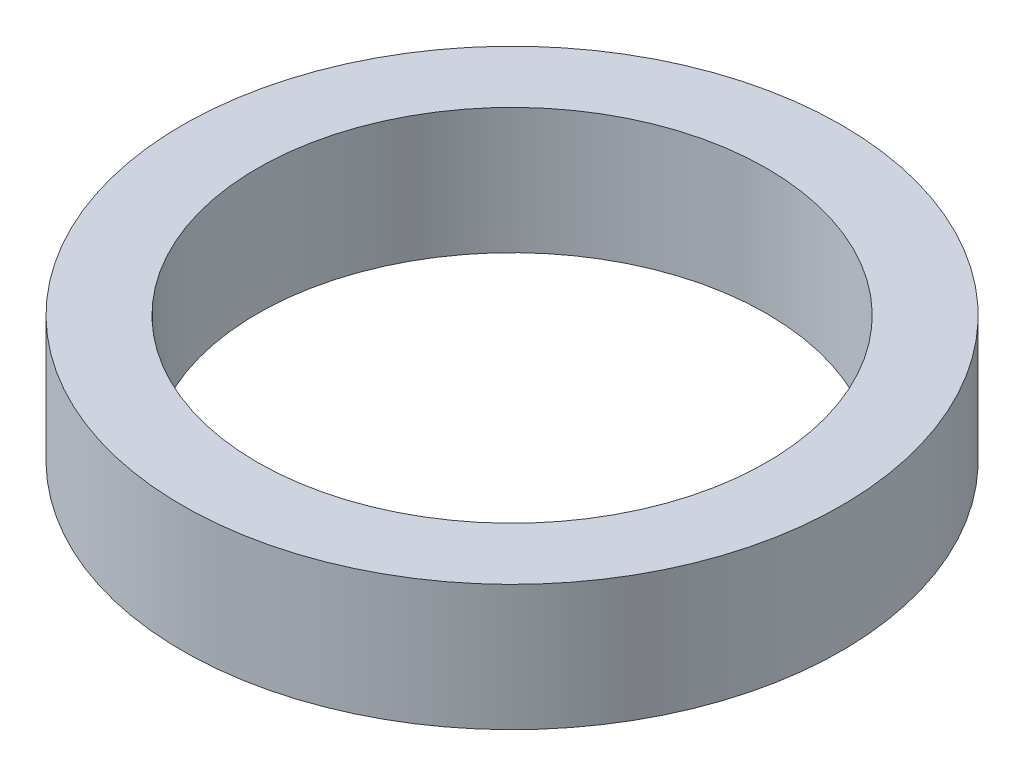
ISO-10303-21;
HEADER;
FILE_DESCRIPTION(('STEP AP214'),'2;1');
FILE_NAME('part.step','',(''),(''),'','','');
FILE_SCHEMA(('AUTOMOTIVE_DESIGN { 1 0 10303 214 1 1 1 1 }'));
ENDSEC;
DATA;
#1=APPLICATION_CONTEXT('core data for automotive mechanical design processes');
#2=APPLICATION_PROTOCOL_DEFINITION('international standard','automotive_design',2000,#1);
#3=PRODUCT_CONTEXT('',#1,'mechanical');
#4=PRODUCT('Part','Part','',(#3));
#5=PRODUCT_RELATED_PRODUCT_CATEGORY('part','',(#4));
#6=PRODUCT_DEFINITION_FORMATION('','',#4);
#7=PRODUCT_DEFINITION_CONTEXT('part definition',#1,'design');
#8=PRODUCT_DEFINITION('design','',#6,#7);
#9=PRODUCT_DEFINITION_SHAPE('','',#8);
#10=(LENGTH_UNIT() NAMED_UNIT(*) SI_UNIT(.MILLI.,.METRE.));
#11=(NAMED_UNIT(*) PLANE_ANGLE_UNIT() SI_UNIT($,.RADIAN.));
#12=(NAMED_UNIT(*) SI_UNIT($,.STERADIAN.) SOLID_ANGLE_UNIT());
#13=UNCERTAINTY_MEASURE_WITH_UNIT(LENGTH_MEASURE(1.E-05),#10,'distance_accuracy_value','');
#14=(GEOMETRIC_REPRESENTATION_CONTEXT(3) GLOBAL_UNCERTAINTY_ASSIGNED_CONTEXT((#13)) GLOBAL_UNIT_ASSIGNED_CONTEXT((#10,
#11,#12)) REPRESENTATION_CONTEXT('',''));
#15=CARTESIAN_POINT('',(0.,0.,0.));
#16=DIRECTION('',(0.,0.,1.));
#17=DIRECTION('',(1.,0.,0.));
#18=AXIS2_PLACEMENT_3D('',#15,#16,#17);
#19=CARTESIAN_POINT('',(0.,21.,0.));
#20=DIRECTION('',(0.,-1.,0.));
#21=DIRECTION('',(0.,0.,-1.));
#22=AXIS2_PLACEMENT_3D('',#19,#20,#21);
#23=CYLINDRICAL_SURFACE('',#22,55.);
#24=CARTESIAN_POINT('',(0.,21.,0.));
#25=DIRECTION('',(0.,1.,0.));
#26=DIRECTION('',(0.,0.,1.));
#27=AXIS2_PLACEMENT_3D('',#24,#25,#26);
#28=CIRCLE('',#27,55.);
#29=CARTESIAN_POINT('',(0.,21.,-55.));
#30=VERTEX_POINT('',#29);
#31=EDGE_CURVE('E10',#30,#30,#28,.T.);
#32=CARTESIAN_POINT('',(0.,0.,0.));
#33=DIRECTION('',(0.,1.,0.));
#34=DIRECTION('',(0.,0.,1.));
#35=AXIS2_PLACEMENT_3D('',#32,#33,#34);
#36=CIRCLE('',#35,55.);
#37=CARTESIAN_POINT('',(0.,0.,-55.));
#38=VERTEX_POINT('',#37);
#39=EDGE_CURVE('E37',#38,#38,#36,.T.);
#40=CARTESIAN_POINT('',(0.,21.,-55.));
#41=CARTESIAN_POINT('',(0.,20.78125,-55.));
#42=CARTESIAN_POINT('',(0.,20.5625,-55.));
#43=CARTESIAN_POINT('',(0.,20.125,-55.));
#44=CARTESIAN_POINT('',(0.,19.90625,-55.));
#45=CARTESIAN_POINT('',(0.,19.46875,-55.));
#46=CARTESIAN_POINT('',(0.,19.25,-55.));
#47=CARTESIAN_POINT('',(0.,18.8125,-55.));
#48=CARTESIAN_POINT('',(0.,18.59375,-55.));
#49=CARTESIAN_POINT('',(0.,18.15625,-55.));
#50=CARTESIAN_POINT('',(0.,17.9375,-55.));
#51=CARTESIAN_POINT('',(0.,17.5,-55.));
#52=CARTESIAN_POINT('',(0.,17.28125,-55.));
#53=CARTESIAN_POINT('',(0.,16.84375,-55.));
#54=CARTESIAN_POINT('',(0.,16.625,-55.));
#55=CARTESIAN_POINT('',(0.,16.1875,-55.));
#56=CARTESIAN_POINT('',(0.,15.96875,-55.));
#57=CARTESIAN_POINT('',(0.,15.53125,-55.));
#58=CARTESIAN_POINT('',(0.,15.3125,-55.));
#59=CARTESIAN_POINT('',(0.,14.875,-55.));
#60=CARTESIAN_POINT('',(0.,14.65625,-55.));
#61=CARTESIAN_POINT('',(0.,14.21875,-55.));
#62=CARTESIAN_POINT('',(0.,14.,-55.));
#63=CARTESIAN_POINT('',(0.,13.5625,-55.));
#64=CARTESIAN_POINT('',(0.,13.34375,-55.));
#65=CARTESIAN_POINT('',(0.,12.90625,-55.));
#66=CARTESIAN_POINT('',(0.,12.6875,-55.));
#67=CARTESIAN_POINT('',(0.,12.25,-55.));
#68=CARTESIAN_POINT('',(0.,12.03125,-55.));
#69=CARTESIAN_POINT('',(0.,11.59375,-55.));
#70=CARTESIAN_POINT('',(0.,11.375,-55.));
#71=CARTESIAN_POINT('',(0.,10.9375,-55.));
#72=CARTESIAN_POINT('',(0.,10.71875,-55.));
#73=CARTESIAN_POINT('',(0.,10.28125,-55.));
#74=CARTESIAN_POINT('',(0.,10.0625,-55.));
#75=CARTESIAN_POINT('',(0.,9.625,-55.));
#76=CARTESIAN_POINT('',(0.,9.40625,-55.));
#77=CARTESIAN_POINT('',(0.,8.96875,-55.));
#78=CARTESIAN_POINT('',(0.,8.75,-55.));
#79=CARTESIAN_POINT('',(0.,8.3125,-55.));
#80=CARTESIAN_POINT('',(0.,8.09375,-55.));
#81=CARTESIAN_POINT('',(0.,7.65625,-55.));
#82=CARTESIAN_POINT('',(0.,7.4375,-55.));
#83=CARTESIAN_POINT('',(0.,7.,-55.));
#84=CARTESIAN_POINT('',(0.,6.78125,-55.));
#85=CARTESIAN_POINT('',(0.,6.34375,-55.));
#86=CARTESIAN_POINT('',(0.,6.125,-55.));
#87=CARTESIAN_POINT('',(0.,5.6875,-55.));
#88=CARTESIAN_POINT('',(0.,5.46875,-55.));
#89=CARTESIAN_POINT('',(0.,5.03125,-55.));
#90=CARTESIAN_POINT('',(0.,4.8125,-55.));
#91=CARTESIAN_POINT('',(0.,4.375,-55.));
#92=CARTESIAN_POINT('',(0.,4.15625,-55.));
#93=CARTESIAN_POINT('',(0.,3.71875,-55.));
#94=CARTESIAN_POINT('',(0.,3.5,-55.));
#95=CARTESIAN_POINT('',(0.,3.0625,-55.));
#96=CARTESIAN_POINT('',(0.,2.84375,-55.));
#97=CARTESIAN_POINT('',(0.,2.40625,-55.));
#98=CARTESIAN_POINT('',(0.,2.1875,-55.));
#99=CARTESIAN_POINT('',(0.,1.75,-55.));
#100=CARTESIAN_POINT('',(0.,1.53125,-55.));
#101=CARTESIAN_POINT('',(0.,1.09375,-55.));
#102=CARTESIAN_POINT('',(0.,0.875000000000001,-55.));
#103=CARTESIAN_POINT('',(0.,0.4375,-55.));
#104=CARTESIAN_POINT('',(0.,0.21875,-55.));
#105=CARTESIAN_POINT('',(0.,0.,-55.));
#106=B_SPLINE_CURVE_WITH_KNOTS('',3,(#40,#41,#42,#43,#44,#45,#46,#47,#48,#49,#50,#51,#52,#53,
#54,#55,#56,#57,#58,#59,#60,#61,#62,#63,#64,#65,#66,#67,#68,#69,#70,#71,#72,#73,#74,#75,#76,#77,
#78,#79,#80,#81,#82,#83,#84,#85,#86,#87,#88,#89,#90,#91,#92,#93,#94,#95,#96,#97,#98,#99,#100,
#101,#102,#103,#104,#105),.UNSPECIFIED.,.F.,.F.,(4,2,2,2,2,2,2,2,2,2,2,2,2,2,2,2,2,2,2,2,2,2,2,
2,2,2,2,2,2,2,2,2,4),(0.,0.656250000000001,1.3125,1.96875,2.625,3.28125,3.9375,4.59375,5.25,
5.90625,6.5625,7.21875,7.875,8.53125,9.1875,9.84375,10.5,11.15625,11.8125,12.46875,13.125,
13.78125,14.4375,15.09375,15.75,16.40625,17.0625,17.71875,18.375,19.03125,19.6875,20.34375,21.),.UNSPECIFIED.);
#107=EDGE_CURVE('BSEAM40',#30,#38,#106,.T.);
#108=ORIENTED_EDGE('',*,*,#31,.F.);
#109=ORIENTED_EDGE('',*,*,#39,.T.);
#110=ORIENTED_EDGE('',*,*,#107,.T.);
#111=ORIENTED_EDGE('',*,*,#107,.F.);
#112=EDGE_LOOP('',(#108,#110,#109,#111));
#113=FACE_BOUND('',#112,.T.);
#114=ADVANCED_FACE('F40',(#113),#23,.T.);
#115=CARTESIAN_POINT('',(0.,21.,0.));
#116=DIRECTION('',(0.,1.,0.));
#117=DIRECTION('',(0.,0.,1.));
#118=AXIS2_PLACEMENT_3D('',#115,#116,#117);
#119=PLANE('',#118);
#120=CARTESIAN_POINT('',(0.,21.,0.));
#121=DIRECTION('',(0.,1.,0.));
#122=DIRECTION('',(0.,0.,1.));
#123=AXIS2_PLACEMENT_3D('',#120,#121,#122);
#124=CIRCLE('',#123,42.5);
#125=CARTESIAN_POINT('',(0.,21.,-42.5));
#126=VERTEX_POINT('',#125);
#127=EDGE_CURVE('E50',#126,#126,#124,.T.);
#128=ORIENTED_EDGE('',*,*,#127,.F.);
#129=EDGE_LOOP('',(#128));
#130=FACE_BOUND('',#129,.T.);
#131=ORIENTED_EDGE('',*,*,#31,.T.);
#132=EDGE_LOOP('',(#131));
#133=FACE_BOUND('',#132,.T.);
#134=ADVANCED_FACE('F59',(#130,#133),#119,.T.);
#135=CARTESIAN_POINT('',(0.,0.,0.));
#136=DIRECTION('',(0.,1.,0.));
#137=DIRECTION('',(0.,0.,1.));
#138=AXIS2_PLACEMENT_3D('',#135,#136,#137);
#139=PLANE('',#138);
#140=CARTESIAN_POINT('',(0.,0.,0.));
#141=DIRECTION('',(0.,1.,0.));
#142=DIRECTION('',(0.,0.,1.));
#143=AXIS2_PLACEMENT_3D('',#140,#141,#142);
#144=CIRCLE('',#143,42.5);
#145=CARTESIAN_POINT('',(0.,0.,-42.5));
#146=VERTEX_POINT('',#145);
#147=EDGE_CURVE('E47',#146,#146,#144,.T.);
#148=ORIENTED_EDGE('',*,*,#147,.T.);
#149=EDGE_LOOP('',(#148));
#150=FACE_BOUND('',#149,.T.);
#151=ORIENTED_EDGE('',*,*,#39,.F.);
#152=EDGE_LOOP('',(#151));
#153=FACE_BOUND('',#152,.T.);
#154=ADVANCED_FACE('F58',(#150,#153),#139,.F.);
#155=CARTESIAN_POINT('',(0.,21.,0.));
#156=DIRECTION('',(0.,-1.,0.));
#157=DIRECTION('',(0.,0.,-1.));
#158=AXIS2_PLACEMENT_3D('',#155,#156,#157);
#159=CYLINDRICAL_SURFACE('',#158,42.5);
#160=CARTESIAN_POINT('',(0.,21.,-42.5));
#161=CARTESIAN_POINT('',(0.,20.78125,-42.5));
#162=CARTESIAN_POINT('',(0.,20.5625,-42.5));
#163=CARTESIAN_POINT('',(0.,20.125,-42.5));
#164=CARTESIAN_POINT('',(0.,19.90625,-42.5));
#165=CARTESIAN_POINT('',(0.,19.46875,-42.5));
#166=CARTESIAN_POINT('',(0.,19.25,-42.5));
#167=CARTESIAN_POINT('',(0.,18.8125,-42.5));
#168=CARTESIAN_POINT('',(0.,18.59375,-42.5));
#169=CARTESIAN_POINT('',(0.,18.15625,-42.5));
#170=CARTESIAN_POINT('',(0.,17.9375,-42.5));
#171=CARTESIAN_POINT('',(0.,17.5,-42.5));
#172=CARTESIAN_POINT('',(0.,17.28125,-42.5));
#173=CARTESIAN_POINT('',(0.,16.84375,-42.5));
#174=CARTESIAN_POINT('',(0.,16.625,-42.5));
#175=CARTESIAN_POINT('',(0.,16.1875,-42.5));
#176=CARTESIAN_POINT('',(0.,15.96875,-42.5));
#177=CARTESIAN_POINT('',(0.,15.53125,-42.5));
#178=CARTESIAN_POINT('',(0.,15.3125,-42.5));
#179=CARTESIAN_POINT('',(0.,14.875,-42.5));
#180=CARTESIAN_POINT('',(0.,14.65625,-42.5));
#181=CARTESIAN_POINT('',(0.,14.21875,-42.5));
#182=CARTESIAN_POINT('',(0.,14.,-42.5));
#183=CARTESIAN_POINT('',(0.,13.5625,-42.5));
#184=CARTESIAN_POINT('',(0.,13.34375,-42.5));
#185=CARTESIAN_POINT('',(0.,12.90625,-42.5));
#186=CARTESIAN_POINT('',(0.,12.6875,-42.5));
#187=CARTESIAN_POINT('',(0.,12.25,-42.5));
#188=CARTESIAN_POINT('',(0.,12.03125,-42.5));
#189=CARTESIAN_POINT('',(0.,11.59375,-42.5));
#190=CARTESIAN_POINT('',(0.,11.375,-42.5));
#191=CARTESIAN_POINT('',(0.,10.9375,-42.5));
#192=CARTESIAN_POINT('',(0.,10.71875,-42.5));
#193=CARTESIAN_POINT('',(0.,10.28125,-42.5));
#194=CARTESIAN_POINT('',(0.,10.0625,-42.5));
#195=CARTESIAN_POINT('',(0.,9.625,-42.5));
#196=CARTESIAN_POINT('',(0.,9.40625,-42.5));
#197=CARTESIAN_POINT('',(0.,8.96875,-42.5));
#198=CARTESIAN_POINT('',(0.,8.75,-42.5));
#199=CARTESIAN_POINT('',(0.,8.3125,-42.5));
#200=CARTESIAN_POINT('',(0.,8.09375,-42.5));
#201=CARTESIAN_POINT('',(0.,7.65625,-42.5));
#202=CARTESIAN_POINT('',(0.,7.4375,-42.5));
#203=CARTESIAN_POINT('',(0.,7.,-42.5));
#204=CARTESIAN_POINT('',(0.,6.78125,-42.5));
#205=CARTESIAN_POINT('',(0.,6.34375,-42.5));
#206=CARTESIAN_POINT('',(0.,6.125,-42.5));
#207=CARTESIAN_POINT('',(0.,5.6875,-42.5));
#208=CARTESIAN_POINT('',(0.,5.46875,-42.5));
#209=CARTESIAN_POINT('',(0.,5.03125,-42.5));
#210=CARTESIAN_POINT('',(0.,4.8125,-42.5));
#211=CARTESIAN_POINT('',(0.,4.375,-42.5));
#212=CARTESIAN_POINT('',(0.,4.15625,-42.5));
#213=CARTESIAN_POINT('',(0.,3.71875,-42.5));
#214=CARTESIAN_POINT('',(0.,3.5,-42.5));
#215=CARTESIAN_POINT('',(0.,3.0625,-42.5));
#216=CARTESIAN_POINT('',(0.,2.84375,-42.5));
#217=CARTESIAN_POINT('',(0.,2.40625,-42.5));
#218=CARTESIAN_POINT('',(0.,2.1875,-42.5));
#219=CARTESIAN_POINT('',(0.,1.75,-42.5));
#220=CARTESIAN_POINT('',(0.,1.53125,-42.5));
#221=CARTESIAN_POINT('',(0.,1.09375,-42.5));
#222=CARTESIAN_POINT('',(0.,0.875000000000001,-42.5));
#223=CARTESIAN_POINT('',(0.,0.4375,-42.5));
#224=CARTESIAN_POINT('',(0.,0.21875,-42.5));
#225=CARTESIAN_POINT('',(0.,0.,-42.5));
#226=B_SPLINE_CURVE_WITH_KNOTS('',3,(#160,#161,#162,#163,#164,#165,#166,#167,#168,#169,#170,
#171,#172,#173,#174,#175,#176,#177,#178,#179,#180,#181,#182,#183,#184,#185,#186,#187,#188,#189,
#190,#191,#192,#193,#194,#195,#196,#197,#198,#199,#200,#201,#202,#203,#204,#205,#206,#207,#208,
#209,#210,#211,#212,#213,#214,#215,#216,#217,#218,#219,#220,#221,#222,#223,#224,#225),
.UNSPECIFIED.,.F.,.F.,(4,2,2,2,2,2,2,2,2,2,2,2,2,2,2,2,2,2,2,2,2,2,2,2,2,2,2,2,2,2,2,2,4),(0.,
0.656249999999997,1.3125,1.96875,2.625,3.28125,3.9375,4.59375,5.25,5.90625,6.5625,7.21875,7.875,
8.53125,9.1875,9.84375,10.5,11.15625,11.8125,12.46875,13.125,13.78125,14.4375,15.09375,15.75,
16.40625,17.0625,17.71875,18.375,19.03125,19.6875,20.34375,21.),.UNSPECIFIED.);
#227=EDGE_CURVE('BSEAM54',#126,#146,#226,.T.);
#228=ORIENTED_EDGE('',*,*,#127,.T.);
#229=ORIENTED_EDGE('',*,*,#147,.F.);
#230=ORIENTED_EDGE('',*,*,#227,.T.);
#231=ORIENTED_EDGE('',*,*,#227,.F.);
#232=EDGE_LOOP('',(#228,#230,#229,#231));
#233=FACE_BOUND('',#232,.T.);
#234=ADVANCED_FACE('F54',(#233),#159,.F.);
#235=CLOSED_SHELL('',(#114,#134,#154,#234));
#236=MANIFOLD_SOLID_BREP('B2',#235);
#237=ADVANCED_BREP_SHAPE_REPRESENTATION('',(#18,#236),#14);
#238=SHAPE_DEFINITION_REPRESENTATION(#9,#237);
ENDSEC;
END-ISO-10303-21;
